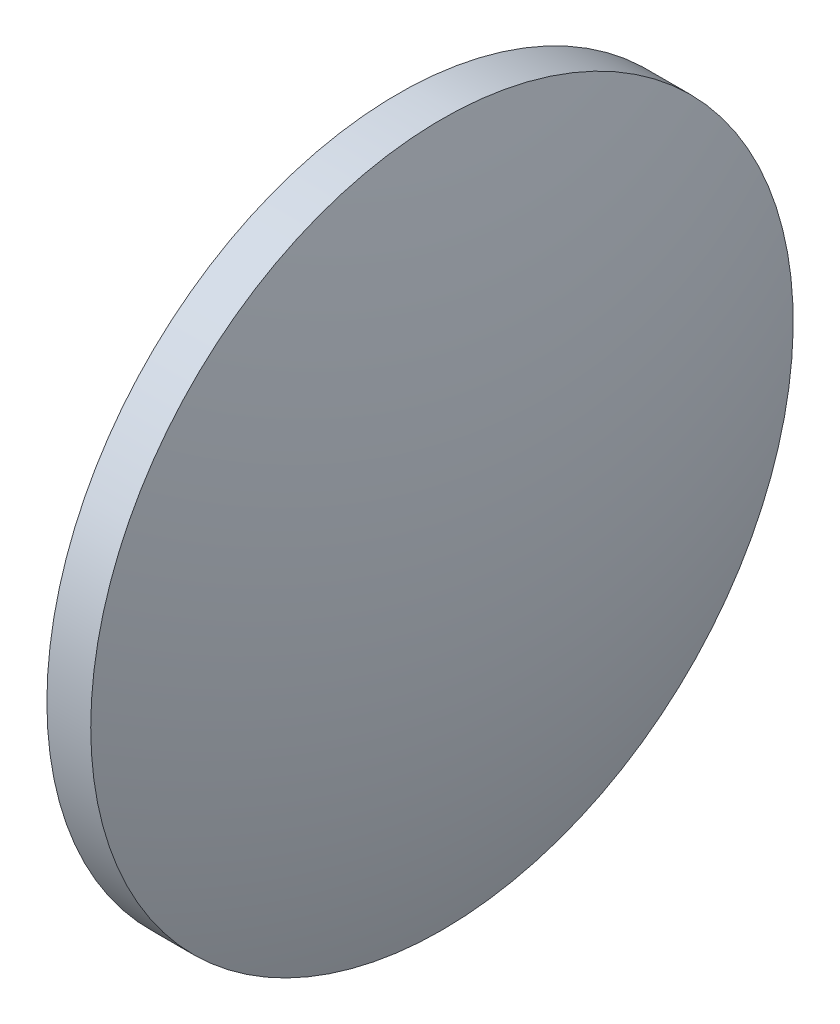
ISO-10303-21;
HEADER;
FILE_DESCRIPTION(('STEP AP214'),'2;1');
FILE_NAME('part.step','',(''),(''),'','','');
FILE_SCHEMA(('AUTOMOTIVE_DESIGN { 1 0 10303 214 1 1 1 1 }'));
ENDSEC;
DATA;
#1=APPLICATION_CONTEXT('core data for automotive mechanical design processes');
#2=APPLICATION_PROTOCOL_DEFINITION('international standard','automotive_design',2000,#1);
#3=PRODUCT_CONTEXT('',#1,'mechanical');
#4=PRODUCT('Part','Part','',(#3));
#5=PRODUCT_RELATED_PRODUCT_CATEGORY('part','',(#4));
#6=PRODUCT_DEFINITION_FORMATION('','',#4);
#7=PRODUCT_DEFINITION_CONTEXT('part definition',#1,'design');
#8=PRODUCT_DEFINITION('design','',#6,#7);
#9=PRODUCT_DEFINITION_SHAPE('','',#8);
#10=(LENGTH_UNIT() NAMED_UNIT(*) SI_UNIT(.MILLI.,.METRE.));
#11=(NAMED_UNIT(*) PLANE_ANGLE_UNIT() SI_UNIT($,.RADIAN.));
#12=(NAMED_UNIT(*) SI_UNIT($,.STERADIAN.) SOLID_ANGLE_UNIT());
#13=UNCERTAINTY_MEASURE_WITH_UNIT(LENGTH_MEASURE(1.E-05),#10,'distance_accuracy_value','');
#14=(GEOMETRIC_REPRESENTATION_CONTEXT(3) GLOBAL_UNCERTAINTY_ASSIGNED_CONTEXT((#13)) GLOBAL_UNIT_ASSIGNED_CONTEXT((#10,
#11,#12)) REPRESENTATION_CONTEXT('',''));
#15=CARTESIAN_POINT('',(0.,0.,0.));
#16=DIRECTION('',(0.,0.,1.));
#17=DIRECTION('',(1.,0.,0.));
#18=AXIS2_PLACEMENT_3D('',#15,#16,#17);
#19=CARTESIAN_POINT('',(664.931645154758,248.698951533926,0.));
#20=DIRECTION('',(-1.,0.,0.));
#21=DIRECTION('',(0.,-1.,0.));
#22=AXIS2_PLACEMENT_3D('',#19,#20,#21);
#23=SPHERICAL_SURFACE('',#22,39.316568627451);
#24=CARTESIAN_POINT('',(702.208213782209,248.698951533925,0.));
#25=DIRECTION('',(-1.,0.,0.));
#26=DIRECTION('',(0.,0.,1.));
#27=AXIS2_PLACEMENT_3D('',#24,#25,#26);
#28=CIRCLE('',#27,12.5);
#29=CARTESIAN_POINT('',(702.208213782209,248.698951533925,12.5));
#30=VERTEX_POINT('',#29);
#31=EDGE_CURVE('E10',#30,#30,#28,.T.);
#32=ORIENTED_EDGE('',*,*,#31,.F.);
#33=EDGE_LOOP('',(#32));
#34=FACE_BOUND('',#33,.T.);
#35=ADVANCED_FACE('F35',(#34),#23,.T.);
#36=CARTESIAN_POINT('',(677.00008881465,248.698951533925,0.));
#37=DIRECTION('',(-1.,0.,0.));
#38=DIRECTION('',(0.,0.,1.));
#39=AXIS2_PLACEMENT_3D('',#36,#37,#38);
#40=CYLINDRICAL_SURFACE('',#39,12.5);
#41=CARTESIAN_POINT('',(700.648213782209,248.698951533925,0.));
#42=DIRECTION('',(-1.,0.,0.));
#43=DIRECTION('',(0.,0.,1.));
#44=AXIS2_PLACEMENT_3D('',#41,#42,#43);
#45=CIRCLE('',#44,12.5);
#46=CARTESIAN_POINT('',(700.648213782209,248.698951533925,12.5));
#47=VERTEX_POINT('',#46);
#48=EDGE_CURVE('E41',#47,#47,#45,.T.);
#49=ORIENTED_EDGE('',*,*,#48,.F.);
#50=EDGE_LOOP('',(#49));
#51=FACE_BOUND('',#50,.T.);
#52=ORIENTED_EDGE('',*,*,#31,.T.);
#53=EDGE_LOOP('',(#52));
#54=FACE_BOUND('',#53,.T.);
#55=ADVANCED_FACE('F49',(#51,#54),#40,.T.);
#56=CARTESIAN_POINT('',(700.648213782209,248.698951533925,0.));
#57=DIRECTION('',(1.,0.,0.));
#58=DIRECTION('',(0.,0.,-1.));
#59=AXIS2_PLACEMENT_3D('',#56,#57,#58);
#60=PLANE('',#59);
#61=ORIENTED_EDGE('',*,*,#48,.T.);
#62=EDGE_LOOP('',(#61));
#63=FACE_BOUND('',#62,.T.);
#64=ADVANCED_FACE('F47',(#63),#60,.F.);
#65=CLOSED_SHELL('',(#35,#55,#64));
#66=MANIFOLD_SOLID_BREP('B2',#65);
#67=ADVANCED_BREP_SHAPE_REPRESENTATION('',(#18,#66),#14);
#68=SHAPE_DEFINITION_REPRESENTATION(#9,#67);
ENDSEC;
END-ISO-10303-21;
